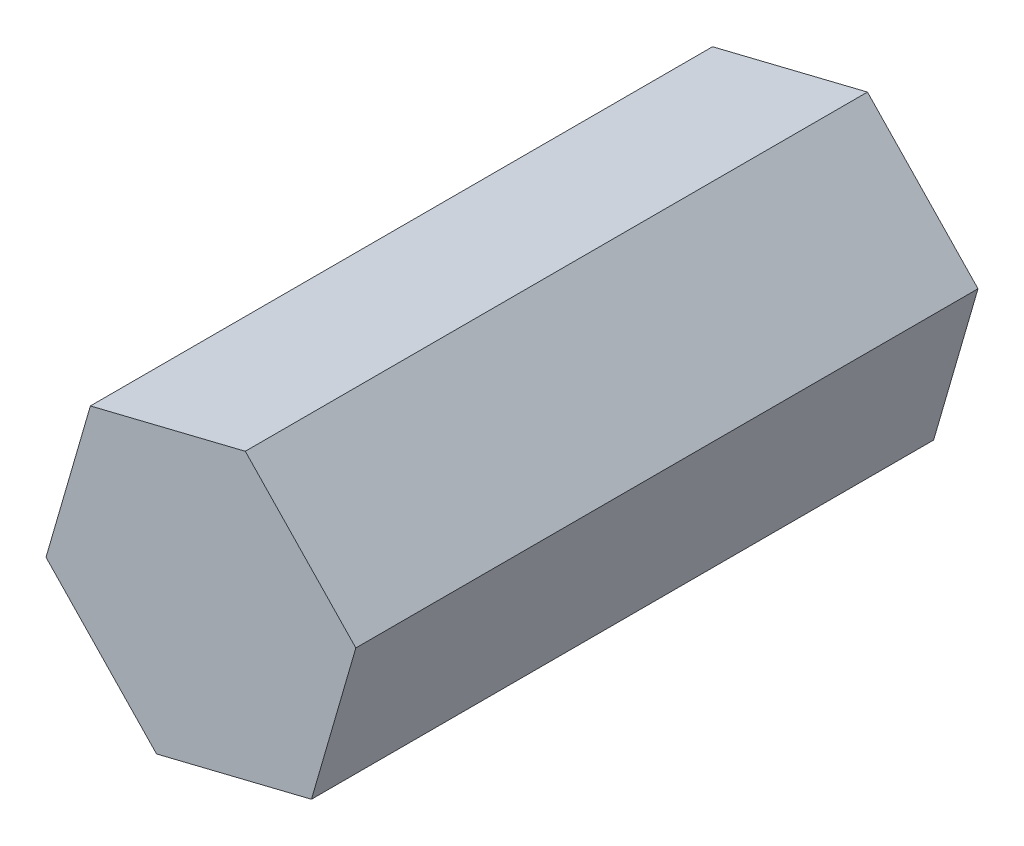
ISO-10303-21;
HEADER;
FILE_DESCRIPTION(('STEP AP214'),'2;1');
FILE_NAME('part.step','',(''),(''),'','','');
FILE_SCHEMA(('AUTOMOTIVE_DESIGN { 1 0 10303 214 1 1 1 1 }'));
ENDSEC;
DATA;
#1=APPLICATION_CONTEXT('core data for automotive mechanical design processes');
#2=APPLICATION_PROTOCOL_DEFINITION('international standard','automotive_design',2000,#1);
#3=PRODUCT_CONTEXT('',#1,'mechanical');
#4=PRODUCT('Part','Part','',(#3));
#5=PRODUCT_RELATED_PRODUCT_CATEGORY('part','',(#4));
#6=PRODUCT_DEFINITION_FORMATION('','',#4);
#7=PRODUCT_DEFINITION_CONTEXT('part definition',#1,'design');
#8=PRODUCT_DEFINITION('design','',#6,#7);
#9=PRODUCT_DEFINITION_SHAPE('','',#8);
#10=(LENGTH_UNIT() NAMED_UNIT(*) SI_UNIT(.MILLI.,.METRE.));
#11=(NAMED_UNIT(*) PLANE_ANGLE_UNIT() SI_UNIT($,.RADIAN.));
#12=(NAMED_UNIT(*) SI_UNIT($,.STERADIAN.) SOLID_ANGLE_UNIT());
#13=UNCERTAINTY_MEASURE_WITH_UNIT(LENGTH_MEASURE(1.E-05),#10,'distance_accuracy_value','');
#14=(GEOMETRIC_REPRESENTATION_CONTEXT(3) GLOBAL_UNCERTAINTY_ASSIGNED_CONTEXT((#13)) GLOBAL_UNIT_ASSIGNED_CONTEXT((#10,
#11,#12)) REPRESENTATION_CONTEXT('',''));
#15=CARTESIAN_POINT('',(0.,0.,0.));
#16=DIRECTION('',(0.,0.,1.));
#17=DIRECTION('',(1.,0.,0.));
#18=AXIS2_PLACEMENT_3D('',#15,#16,#17);
#19=CARTESIAN_POINT('',(-81.3201209992507,15.6906274893315,15.));
#20=DIRECTION('',(-0.721165051952485,-0.692763284132733,0.));
#21=DIRECTION('',(0.692763284132733,-0.721165051952485,0.));
#22=AXIS2_PLACEMENT_3D('',#19,#20,#21);
#23=PLANE('',#22);
#24=DIRECTION('',(-0.692763284132733,0.721165051952485,0.));
#25=VECTOR('',#24,1.);
#26=CARTESIAN_POINT('',(-81.3201209992507,15.6906274893315,0.));
#27=LINE('',#26,#25);
#28=CARTESIAN_POINT('',(-81.3201209992507,15.6906274893315,0.));
#29=VERTEX_POINT('',#28);
#30=CARTESIAN_POINT('',(-83.9850552536465,18.4648181747216,0.));
#31=VERTEX_POINT('',#30);
#32=EDGE_CURVE('E118',#29,#31,#27,.T.);
#33=ORIENTED_EDGE('',*,*,#32,.T.);
#34=DIRECTION('',(0.,0.,-1.));
#35=VECTOR('',#34,1.);
#36=CARTESIAN_POINT('',(-83.9850552536465,18.4648181747216,15.));
#37=LINE('',#36,#35);
#38=CARTESIAN_POINT('',(-83.9850552536465,18.4648181747216,15.));
#39=VERTEX_POINT('',#38);
#40=EDGE_CURVE('E11',#39,#31,#37,.T.);
#41=ORIENTED_EDGE('',*,*,#40,.F.);
#42=DIRECTION('',(-0.692763284132733,0.721165051952485,0.));
#43=VECTOR('',#42,1.);
#44=CARTESIAN_POINT('',(-81.3201209992507,15.6906274893315,15.));
#45=LINE('',#44,#43);
#46=CARTESIAN_POINT('',(-81.3201209992507,15.6906274893315,15.));
#47=VERTEX_POINT('',#46);
#48=EDGE_CURVE('E128',#47,#39,#45,.T.);
#49=ORIENTED_EDGE('',*,*,#48,.F.);
#50=DIRECTION('',(0.,0.,-1.));
#51=VECTOR('',#50,1.);
#52=CARTESIAN_POINT('',(-81.3201209992507,15.6906274893315,15.));
#53=LINE('',#52,#51);
#54=EDGE_CURVE('E114',#47,#29,#53,.T.);
#55=ORIENTED_EDGE('',*,*,#54,.T.);
#56=EDGE_LOOP('',(#33,#41,#49,#55));
#57=FACE_BOUND('',#56,.T.);
#58=ADVANCED_FACE('F34',(#57),#23,.F.);
#59=CARTESIAN_POINT('',(-83.9850552536465,18.4648181747216,15.));
#60=DIRECTION('',(0.239368076891839,-0.970928897378743,0.));
#61=DIRECTION('',(0.970928897378744,0.239368076891839,0.));
#62=AXIS2_PLACEMENT_3D('',#59,#60,#61);
#63=PLANE('',#62);
#64=DIRECTION('',(-0.970928897378744,-0.239368076891839,0.));
#65=VECTOR('',#64,1.);
#66=CARTESIAN_POINT('',(-83.9850552536465,18.4648181747216,0.));
#67=LINE('',#66,#65);
#68=CARTESIAN_POINT('',(-87.7200419893343,17.5440127536946,0.));
#69=VERTEX_POINT('',#68);
#70=EDGE_CURVE('E121',#31,#69,#67,.T.);
#71=ORIENTED_EDGE('',*,*,#70,.T.);
#72=DIRECTION('',(0.,0.,-1.));
#73=VECTOR('',#72,1.);
#74=CARTESIAN_POINT('',(-87.7200419893343,17.5440127536946,15.));
#75=LINE('',#74,#73);
#76=CARTESIAN_POINT('',(-87.7200419893343,17.5440127536946,15.));
#77=VERTEX_POINT('',#76);
#78=EDGE_CURVE('E42',#77,#69,#75,.T.);
#79=ORIENTED_EDGE('',*,*,#78,.F.);
#80=DIRECTION('',(-0.970928897378744,-0.239368076891839,0.));
#81=VECTOR('',#80,1.);
#82=CARTESIAN_POINT('',(-83.9850552536465,18.4648181747216,15.));
#83=LINE('',#82,#81);
#84=EDGE_CURVE('E87',#39,#77,#83,.T.);
#85=ORIENTED_EDGE('',*,*,#84,.F.);
#86=ORIENTED_EDGE('',*,*,#40,.T.);
#87=EDGE_LOOP('',(#71,#79,#85,#86));
#88=FACE_BOUND('',#87,.T.);
#89=ADVANCED_FACE('F152',(#88),#63,.F.);
#90=CARTESIAN_POINT('',(-87.7200419893343,17.5440127536946,15.));
#91=DIRECTION('',(0.960533128844326,-0.278165613246011,0.));
#92=DIRECTION('',(0.278165613246011,0.960533128844326,0.));
#93=AXIS2_PLACEMENT_3D('',#90,#91,#92);
#94=PLANE('',#93);
#95=DIRECTION('',(-0.278165613246011,-0.960533128844326,0.));
#96=VECTOR('',#95,1.);
#97=CARTESIAN_POINT('',(-87.7200419893343,17.5440127536946,0.));
#98=LINE('',#97,#96);
#99=CARTESIAN_POINT('',(-88.7900944706265,13.8490166472775,0.));
#100=VERTEX_POINT('',#99);
#101=EDGE_CURVE('E123',#69,#100,#98,.T.);
#102=ORIENTED_EDGE('',*,*,#101,.T.);
#103=DIRECTION('',(0.,0.,-1.));
#104=VECTOR('',#103,1.);
#105=CARTESIAN_POINT('',(-88.7900944706265,13.8490166472775,15.));
#106=LINE('',#105,#104);
#107=CARTESIAN_POINT('',(-88.7900944706265,13.8490166472775,15.));
#108=VERTEX_POINT('',#107);
#109=EDGE_CURVE('E109',#108,#100,#106,.T.);
#110=ORIENTED_EDGE('',*,*,#109,.F.);
#111=DIRECTION('',(-0.278165613246011,-0.960533128844326,0.));
#112=VECTOR('',#111,1.);
#113=CARTESIAN_POINT('',(-87.7200419893343,17.5440127536946,15.));
#114=LINE('',#113,#112);
#115=EDGE_CURVE('E100',#77,#108,#114,.T.);
#116=ORIENTED_EDGE('',*,*,#115,.F.);
#117=ORIENTED_EDGE('',*,*,#78,.T.);
#118=EDGE_LOOP('',(#102,#110,#116,#117));
#119=FACE_BOUND('',#118,.T.);
#120=ADVANCED_FACE('F134',(#119),#94,.F.);
#121=CARTESIAN_POINT('',(-88.7900944706265,13.8490166472775,15.));
#122=DIRECTION('',(0.721165051952487,0.692763284132731,0.));
#123=DIRECTION('',(-0.692763284132731,0.721165051952487,0.));
#124=AXIS2_PLACEMENT_3D('',#121,#122,#123);
#125=PLANE('',#124);
#126=DIRECTION('',(0.692763284132731,-0.721165051952487,0.));
#127=VECTOR('',#126,1.);
#128=CARTESIAN_POINT('',(-88.7900944706265,13.8490166472775,0.));
#129=LINE('',#128,#127);
#130=CARTESIAN_POINT('',(-86.1251602162307,11.0748259618874,0.));
#131=VERTEX_POINT('',#130);
#132=EDGE_CURVE('E108',#100,#131,#129,.T.);
#133=ORIENTED_EDGE('',*,*,#132,.T.);
#134=DIRECTION('',(0.,0.,-1.));
#135=VECTOR('',#134,1.);
#136=CARTESIAN_POINT('',(-86.1251602162307,11.0748259618874,15.));
#137=LINE('',#136,#135);
#138=CARTESIAN_POINT('',(-86.1251602162307,11.0748259618874,15.));
#139=VERTEX_POINT('',#138);
#140=EDGE_CURVE('E105',#139,#131,#137,.T.);
#141=ORIENTED_EDGE('',*,*,#140,.F.);
#142=DIRECTION('',(0.692763284132731,-0.721165051952487,0.));
#143=VECTOR('',#142,1.);
#144=CARTESIAN_POINT('',(-88.7900944706265,13.8490166472775,15.));
#145=LINE('',#144,#143);
#146=EDGE_CURVE('E94',#108,#139,#145,.T.);
#147=ORIENTED_EDGE('',*,*,#146,.F.);
#148=ORIENTED_EDGE('',*,*,#109,.T.);
#149=EDGE_LOOP('',(#133,#141,#147,#148));
#150=FACE_BOUND('',#149,.T.);
#151=ADVANCED_FACE('F106',(#150),#125,.F.);
#152=CARTESIAN_POINT('',(-86.1251602162307,11.0748259618874,15.));
#153=DIRECTION('',(-0.23936807689184,0.970928897378743,0.));
#154=DIRECTION('',(-0.970928897378743,-0.23936807689184,0.));
#155=AXIS2_PLACEMENT_3D('',#152,#153,#154);
#156=PLANE('',#155);
#157=DIRECTION('',(0.970928897378743,0.23936807689184,0.));
#158=VECTOR('',#157,1.);
#159=CARTESIAN_POINT('',(-86.1251602162307,11.0748259618874,0.));
#160=LINE('',#159,#158);
#161=CARTESIAN_POINT('',(-82.3901734805428,11.9956313829144,0.));
#162=VERTEX_POINT('',#161);
#163=EDGE_CURVE('E73',#131,#162,#160,.T.);
#164=ORIENTED_EDGE('',*,*,#163,.T.);
#165=DIRECTION('',(0.,0.,-1.));
#166=VECTOR('',#165,1.);
#167=CARTESIAN_POINT('',(-82.3901734805428,11.9956313829144,15.));
#168=LINE('',#167,#166);
#169=CARTESIAN_POINT('',(-82.3901734805428,11.9956313829144,15.));
#170=VERTEX_POINT('',#169);
#171=EDGE_CURVE('E110',#170,#162,#168,.T.);
#172=ORIENTED_EDGE('',*,*,#171,.F.);
#173=DIRECTION('',(0.970928897378743,0.23936807689184,0.));
#174=VECTOR('',#173,1.);
#175=CARTESIAN_POINT('',(-86.1251602162307,11.0748259618874,15.));
#176=LINE('',#175,#174);
#177=EDGE_CURVE('E98',#139,#170,#176,.T.);
#178=ORIENTED_EDGE('',*,*,#177,.F.);
#179=ORIENTED_EDGE('',*,*,#140,.T.);
#180=EDGE_LOOP('',(#164,#172,#178,#179));
#181=FACE_BOUND('',#180,.T.);
#182=ADVANCED_FACE('F112',(#181),#156,.F.);
#183=CARTESIAN_POINT('',(-82.3901734805428,11.9956313829144,15.));
#184=DIRECTION('',(-0.960533128844327,0.278165613246007,0.));
#185=DIRECTION('',(-0.278165613246007,-0.960533128844327,0.));
#186=AXIS2_PLACEMENT_3D('',#183,#184,#185);
#187=PLANE('',#186);
#188=DIRECTION('',(0.278165613246007,0.960533128844327,0.));
#189=VECTOR('',#188,1.);
#190=CARTESIAN_POINT('',(-82.3901734805428,11.9956313829144,0.));
#191=LINE('',#190,#189);
#192=EDGE_CURVE('E79',#162,#29,#191,.T.);
#193=ORIENTED_EDGE('',*,*,#192,.T.);
#194=ORIENTED_EDGE('',*,*,#54,.F.);
#195=DIRECTION('',(0.278165613246007,0.960533128844327,0.));
#196=VECTOR('',#195,1.);
#197=CARTESIAN_POINT('',(-82.3901734805428,11.9956313829144,15.));
#198=LINE('',#197,#196);
#199=EDGE_CURVE('E50',#170,#47,#198,.T.);
#200=ORIENTED_EDGE('',*,*,#199,.F.);
#201=ORIENTED_EDGE('',*,*,#171,.T.);
#202=EDGE_LOOP('',(#193,#194,#200,#201));
#203=FACE_BOUND('',#202,.T.);
#204=ADVANCED_FACE('F141',(#203),#187,.F.);
#205=CARTESIAN_POINT('',(0.,0.,15.));
#206=DIRECTION('',(0.,0.,1.));
#207=DIRECTION('',(1.,0.,0.));
#208=AXIS2_PLACEMENT_3D('',#205,#206,#207);
#209=PLANE('',#208);
#210=ORIENTED_EDGE('',*,*,#48,.T.);
#211=ORIENTED_EDGE('',*,*,#84,.T.);
#212=ORIENTED_EDGE('',*,*,#115,.T.);
#213=ORIENTED_EDGE('',*,*,#146,.T.);
#214=ORIENTED_EDGE('',*,*,#177,.T.);
#215=ORIENTED_EDGE('',*,*,#199,.T.);
#216=EDGE_LOOP('',(#210,#211,#212,#213,#214,#215));
#217=FACE_BOUND('',#216,.T.);
#218=ADVANCED_FACE('F96',(#217),#209,.T.);
#219=CARTESIAN_POINT('',(0.,0.,0.));
#220=DIRECTION('',(0.,0.,1.));
#221=DIRECTION('',(1.,0.,0.));
#222=AXIS2_PLACEMENT_3D('',#219,#220,#221);
#223=PLANE('',#222);
#224=ORIENTED_EDGE('',*,*,#32,.F.);
#225=ORIENTED_EDGE('',*,*,#192,.F.);
#226=ORIENTED_EDGE('',*,*,#163,.F.);
#227=ORIENTED_EDGE('',*,*,#132,.F.);
#228=ORIENTED_EDGE('',*,*,#101,.F.);
#229=ORIENTED_EDGE('',*,*,#70,.F.);
#230=EDGE_LOOP('',(#224,#225,#226,#227,#228,#229));
#231=FACE_BOUND('',#230,.T.);
#232=ADVANCED_FACE('F137',(#231),#223,.F.);
#233=CLOSED_SHELL('',(#58,#89,#120,#151,#182,#204,#218,#232));
#234=MANIFOLD_SOLID_BREP('B2',#233);
#235=ADVANCED_BREP_SHAPE_REPRESENTATION('',(#18,#234),#14);
#236=SHAPE_DEFINITION_REPRESENTATION(#9,#235);
ENDSEC;
END-ISO-10303-21;
